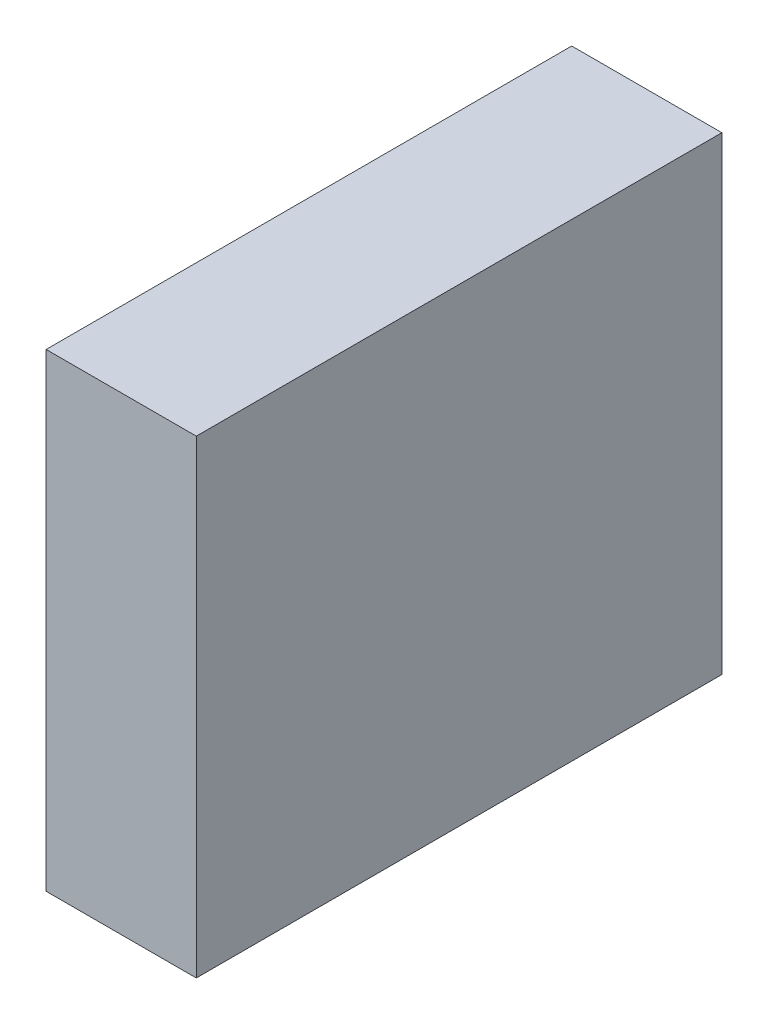
ISO-10303-21;
HEADER;
FILE_DESCRIPTION(('STEP AP214'),'2;1');
FILE_NAME('part.step','',(''),(''),'','','');
FILE_SCHEMA(('AUTOMOTIVE_DESIGN { 1 0 10303 214 1 1 1 1 }'));
ENDSEC;
DATA;
#1=APPLICATION_CONTEXT('core data for automotive mechanical design processes');
#2=APPLICATION_PROTOCOL_DEFINITION('international standard','automotive_design',2000,#1);
#3=PRODUCT_CONTEXT('',#1,'mechanical');
#4=PRODUCT('Part','Part','',(#3));
#5=PRODUCT_RELATED_PRODUCT_CATEGORY('part','',(#4));
#6=PRODUCT_DEFINITION_FORMATION('','',#4);
#7=PRODUCT_DEFINITION_CONTEXT('part definition',#1,'design');
#8=PRODUCT_DEFINITION('design','',#6,#7);
#9=PRODUCT_DEFINITION_SHAPE('','',#8);
#10=(LENGTH_UNIT() NAMED_UNIT(*) SI_UNIT(.MILLI.,.METRE.));
#11=(NAMED_UNIT(*) PLANE_ANGLE_UNIT() SI_UNIT($,.RADIAN.));
#12=(NAMED_UNIT(*) SI_UNIT($,.STERADIAN.) SOLID_ANGLE_UNIT());
#13=UNCERTAINTY_MEASURE_WITH_UNIT(LENGTH_MEASURE(1.E-05),#10,'distance_accuracy_value','');
#14=(GEOMETRIC_REPRESENTATION_CONTEXT(3) GLOBAL_UNCERTAINTY_ASSIGNED_CONTEXT((#13)) GLOBAL_UNIT_ASSIGNED_CONTEXT((#10,
#11,#12)) REPRESENTATION_CONTEXT('',''));
#15=CARTESIAN_POINT('',(0.,0.,0.));
#16=DIRECTION('',(0.,0.,1.));
#17=DIRECTION('',(1.,0.,0.));
#18=AXIS2_PLACEMENT_3D('',#15,#16,#17);
#19=CARTESIAN_POINT('',(-0.1999996,0.62500002,0.));
#20=DIRECTION('',(1.,0.,0.));
#21=DIRECTION('',(0.,0.,-1.));
#22=AXIS2_PLACEMENT_3D('',#19,#20,#21);
#23=PLANE('',#22);
#24=DIRECTION('',(0.,0.,1.));
#25=VECTOR('',#24,1.);
#26=CARTESIAN_POINT('',(-0.1999996,-0.62500002,0.));
#27=LINE('',#26,#25);
#28=CARTESIAN_POINT('',(-0.1999996,-0.62500002,0.));
#29=VERTEX_POINT('',#28);
#30=CARTESIAN_POINT('',(-0.1999996,-0.62500002,1.39999974));
#31=VERTEX_POINT('',#30);
#32=EDGE_CURVE('E20',#29,#31,#27,.T.);
#33=ORIENTED_EDGE('',*,*,#32,.T.);
#34=DIRECTION('',(0.,1.,0.));
#35=VECTOR('',#34,1.);
#36=CARTESIAN_POINT('',(-0.1999996,-0.62500002,1.39999974));
#37=LINE('',#36,#35);
#38=CARTESIAN_POINT('',(-0.1999996,0.62500002,1.39999974));
#39=VERTEX_POINT('',#38);
#40=EDGE_CURVE('E55',#31,#39,#37,.T.);
#41=ORIENTED_EDGE('',*,*,#40,.T.);
#42=DIRECTION('',(0.,0.,-1.));
#43=VECTOR('',#42,1.);
#44=CARTESIAN_POINT('',(-0.1999996,0.62500002,0.));
#45=LINE('',#44,#43);
#46=CARTESIAN_POINT('',(-0.1999996,0.62500002,0.));
#47=VERTEX_POINT('',#46);
#48=EDGE_CURVE('E74',#39,#47,#45,.T.);
#49=ORIENTED_EDGE('',*,*,#48,.T.);
#50=DIRECTION('',(0.,1.,0.));
#51=VECTOR('',#50,1.);
#52=CARTESIAN_POINT('',(-0.1999996,-0.62500002,0.));
#53=LINE('',#52,#51);
#54=EDGE_CURVE('E66',#29,#47,#53,.T.);
#55=ORIENTED_EDGE('',*,*,#54,.F.);
#56=EDGE_LOOP('',(#33,#41,#49,#55));
#57=FACE_BOUND('',#56,.T.);
#58=ADVANCED_FACE('F17',(#57),#23,.F.);
#59=CARTESIAN_POINT('',(-0.1999996,-0.62500002,0.));
#60=DIRECTION('',(0.,1.,0.));
#61=DIRECTION('',(0.,0.,1.));
#62=AXIS2_PLACEMENT_3D('',#59,#60,#61);
#63=PLANE('',#62);
#64=DIRECTION('',(0.,0.,1.));
#65=VECTOR('',#64,1.);
#66=CARTESIAN_POINT('',(0.1999996,-0.62500002,0.));
#67=LINE('',#66,#65);
#68=CARTESIAN_POINT('',(0.1999996,-0.62500002,0.));
#69=VERTEX_POINT('',#68);
#70=CARTESIAN_POINT('',(0.1999996,-0.62500002,1.39999974));
#71=VERTEX_POINT('',#70);
#72=EDGE_CURVE('E72',#69,#71,#67,.T.);
#73=ORIENTED_EDGE('',*,*,#72,.T.);
#74=DIRECTION('',(-1.,0.,0.));
#75=VECTOR('',#74,1.);
#76=CARTESIAN_POINT('',(-0.1999996,-0.62500002,1.39999974));
#77=LINE('',#76,#75);
#78=EDGE_CURVE('E62',#71,#31,#77,.T.);
#79=ORIENTED_EDGE('',*,*,#78,.T.);
#80=ORIENTED_EDGE('',*,*,#32,.F.);
#81=DIRECTION('',(-1.,0.,0.));
#82=VECTOR('',#81,1.);
#83=CARTESIAN_POINT('',(-0.1999996,-0.62500002,0.));
#84=LINE('',#83,#82);
#85=EDGE_CURVE('E80',#69,#29,#84,.T.);
#86=ORIENTED_EDGE('',*,*,#85,.F.);
#87=EDGE_LOOP('',(#73,#79,#80,#86));
#88=FACE_BOUND('',#87,.T.);
#89=ADVANCED_FACE('F71',(#88),#63,.F.);
#90=CARTESIAN_POINT('',(-0.1999996,-0.62500002,1.39999974));
#91=DIRECTION('',(0.,0.,-1.));
#92=DIRECTION('',(-1.,0.,0.));
#93=AXIS2_PLACEMENT_3D('',#90,#91,#92);
#94=PLANE('',#93);
#95=DIRECTION('',(0.,1.,0.));
#96=VECTOR('',#95,1.);
#97=CARTESIAN_POINT('',(0.1999996,-0.62500002,1.39999974));
#98=LINE('',#97,#96);
#99=CARTESIAN_POINT('',(0.1999996,0.62500002,1.39999974));
#100=VERTEX_POINT('',#99);
#101=EDGE_CURVE('E83',#71,#100,#98,.T.);
#102=ORIENTED_EDGE('',*,*,#101,.T.);
#103=DIRECTION('',(1.,0.,0.));
#104=VECTOR('',#103,1.);
#105=CARTESIAN_POINT('',(0.1999996,0.62500002,1.39999974));
#106=LINE('',#105,#104);
#107=EDGE_CURVE('E64',#100,#39,#106,.F.);
#108=ORIENTED_EDGE('',*,*,#107,.T.);
#109=ORIENTED_EDGE('',*,*,#40,.F.);
#110=ORIENTED_EDGE('',*,*,#78,.F.);
#111=EDGE_LOOP('',(#102,#108,#109,#110));
#112=FACE_BOUND('',#111,.T.);
#113=ADVANCED_FACE('F60',(#112),#94,.F.);
#114=CARTESIAN_POINT('',(0.1999996,0.62500002,0.));
#115=DIRECTION('',(0.,-1.,0.));
#116=DIRECTION('',(0.,0.,-1.));
#117=AXIS2_PLACEMENT_3D('',#114,#115,#116);
#118=PLANE('',#117);
#119=ORIENTED_EDGE('',*,*,#48,.F.);
#120=ORIENTED_EDGE('',*,*,#107,.F.);
#121=DIRECTION('',(0.,0.,1.));
#122=VECTOR('',#121,1.);
#123=CARTESIAN_POINT('',(0.1999996,0.62500002,0.));
#124=LINE('',#123,#122);
#125=CARTESIAN_POINT('',(0.1999996,0.62500002,0.));
#126=VERTEX_POINT('',#125);
#127=EDGE_CURVE('E26',#100,#126,#124,.F.);
#128=ORIENTED_EDGE('',*,*,#127,.T.);
#129=DIRECTION('',(-1.,0.,0.));
#130=VECTOR('',#129,1.);
#131=CARTESIAN_POINT('',(-0.1999996,0.62500002,0.));
#132=LINE('',#131,#130);
#133=EDGE_CURVE('E34',#47,#126,#132,.F.);
#134=ORIENTED_EDGE('',*,*,#133,.F.);
#135=EDGE_LOOP('',(#119,#120,#128,#134));
#136=FACE_BOUND('',#135,.T.);
#137=ADVANCED_FACE('F88',(#136),#118,.F.);
#138=CARTESIAN_POINT('',(-0.1999996,-0.62500002,0.));
#139=DIRECTION('',(0.,0.,-1.));
#140=DIRECTION('',(-1.,0.,0.));
#141=AXIS2_PLACEMENT_3D('',#138,#139,#140);
#142=PLANE('',#141);
#143=DIRECTION('',(0.,1.,0.));
#144=VECTOR('',#143,1.);
#145=CARTESIAN_POINT('',(0.1999996,-0.62500002,0.));
#146=LINE('',#145,#144);
#147=EDGE_CURVE('E11',#126,#69,#146,.F.);
#148=ORIENTED_EDGE('',*,*,#147,.T.);
#149=ORIENTED_EDGE('',*,*,#85,.T.);
#150=ORIENTED_EDGE('',*,*,#54,.T.);
#151=ORIENTED_EDGE('',*,*,#133,.T.);
#152=EDGE_LOOP('',(#148,#149,#150,#151));
#153=FACE_BOUND('',#152,.T.);
#154=ADVANCED_FACE('F91',(#153),#142,.T.);
#155=CARTESIAN_POINT('',(0.1999996,-0.62500002,0.));
#156=DIRECTION('',(-1.,0.,0.));
#157=DIRECTION('',(0.,0.,1.));
#158=AXIS2_PLACEMENT_3D('',#155,#156,#157);
#159=PLANE('',#158);
#160=ORIENTED_EDGE('',*,*,#127,.F.);
#161=ORIENTED_EDGE('',*,*,#101,.F.);
#162=ORIENTED_EDGE('',*,*,#72,.F.);
#163=ORIENTED_EDGE('',*,*,#147,.F.);
#164=EDGE_LOOP('',(#160,#161,#162,#163));
#165=FACE_BOUND('',#164,.T.);
#166=ADVANCED_FACE('F90',(#165),#159,.F.);
#167=CLOSED_SHELL('',(#58,#89,#113,#137,#154,#166));
#168=MANIFOLD_SOLID_BREP('B1',#167);
#169=ADVANCED_BREP_SHAPE_REPRESENTATION('',(#18,#168),#14);
#170=SHAPE_DEFINITION_REPRESENTATION(#9,#169);
ENDSEC;
END-ISO-10303-21;
